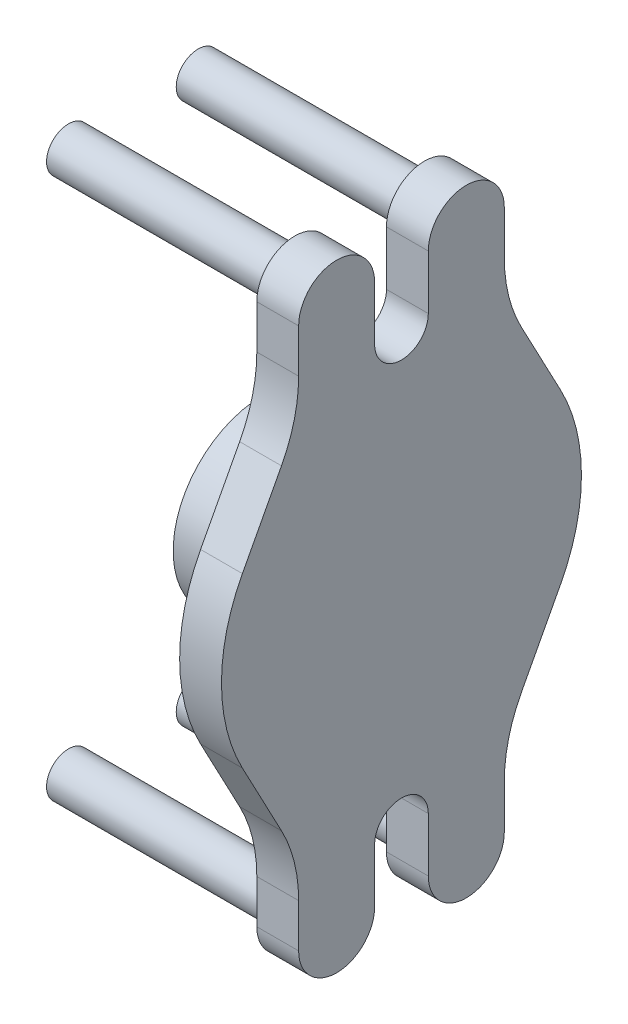
ISO-10303-21;
HEADER;
FILE_DESCRIPTION(('STEP AP214'),'2;1');
FILE_NAME('part.step','',(''),(''),'','','');
FILE_SCHEMA(('AUTOMOTIVE_DESIGN { 1 0 10303 214 1 1 1 1 }'));
ENDSEC;
DATA;
#1=APPLICATION_CONTEXT('core data for automotive mechanical design processes');
#2=APPLICATION_PROTOCOL_DEFINITION('international standard','automotive_design',2000,#1);
#3=PRODUCT_CONTEXT('',#1,'mechanical');
#4=PRODUCT('Part','Part','',(#3));
#5=PRODUCT_RELATED_PRODUCT_CATEGORY('part','',(#4));
#6=PRODUCT_DEFINITION_FORMATION('','',#4);
#7=PRODUCT_DEFINITION_CONTEXT('part definition',#1,'design');
#8=PRODUCT_DEFINITION('design','',#6,#7);
#9=PRODUCT_DEFINITION_SHAPE('','',#8);
#10=(LENGTH_UNIT() NAMED_UNIT(*) SI_UNIT(.MILLI.,.METRE.));
#11=(NAMED_UNIT(*) PLANE_ANGLE_UNIT() SI_UNIT($,.RADIAN.));
#12=(NAMED_UNIT(*) SI_UNIT($,.STERADIAN.) SOLID_ANGLE_UNIT());
#13=UNCERTAINTY_MEASURE_WITH_UNIT(LENGTH_MEASURE(1.E-05),#10,'distance_accuracy_value','');
#14=(GEOMETRIC_REPRESENTATION_CONTEXT(3) GLOBAL_UNCERTAINTY_ASSIGNED_CONTEXT((#13)) GLOBAL_UNIT_ASSIGNED_CONTEXT((#10,
#11,#12)) REPRESENTATION_CONTEXT('',''));
#15=CARTESIAN_POINT('',(0.,0.,0.));
#16=DIRECTION('',(0.,0.,1.));
#17=DIRECTION('',(1.,0.,0.));
#18=AXIS2_PLACEMENT_3D('',#15,#16,#17);
#19=CARTESIAN_POINT('',(36.4,17.1151545626375,32.3245303182742));
#20=DIRECTION('',(0.,-0.467934015820141,-0.883763405464628));
#21=DIRECTION('',(0.,0.883763405464628,-0.467934015820141));
#22=AXIS2_PLACEMENT_3D('',#19,#20,#21);
#23=PLANE('',#22);
#24=DIRECTION('',(0.,-0.883763405464628,0.467934015820141));
#25=VECTOR('',#24,1.);
#26=CARTESIAN_POINT('',(27.9,17.1151545626375,32.3245303182742));
#27=LINE('',#26,#25);
#28=CARTESIAN_POINT('',(27.9,32.1151545626375,24.3823478360612));
#29=VERTEX_POINT('',#28);
#30=CARTESIAN_POINT('',(27.9,17.1151545626375,32.3245303182742));
#31=VERTEX_POINT('',#30);
#32=EDGE_CURVE('E237',#29,#31,#27,.T.);
#33=ORIENTED_EDGE('',*,*,#32,.T.);
#34=DIRECTION('',(-1.,0.,0.));
#35=VECTOR('',#34,1.);
#36=CARTESIAN_POINT('',(36.4,17.1151545626375,32.3245303182742));
#37=LINE('',#36,#35);
#38=CARTESIAN_POINT('',(36.4,17.1151545626375,32.3245303182742));
#39=VERTEX_POINT('',#38);
#40=EDGE_CURVE('E346',#39,#31,#37,.T.);
#41=ORIENTED_EDGE('',*,*,#40,.F.);
#42=DIRECTION('',(0.,-0.883763405464628,0.467934015820141));
#43=VECTOR('',#42,1.);
#44=CARTESIAN_POINT('',(36.4,17.1151545626375,32.3245303182742));
#45=LINE('',#44,#43);
#46=CARTESIAN_POINT('',(36.4,32.1151545626375,24.3823478360612));
#47=VERTEX_POINT('',#46);
#48=EDGE_CURVE('E296',#47,#39,#45,.T.);
#49=ORIENTED_EDGE('',*,*,#48,.F.);
#50=DIRECTION('',(-1.,0.,0.));
#51=VECTOR('',#50,1.);
#52=CARTESIAN_POINT('',(36.4,32.1151545626375,24.3823478360612));
#53=LINE('',#52,#51);
#54=EDGE_CURVE('E233',#47,#29,#53,.T.);
#55=ORIENTED_EDGE('',*,*,#54,.T.);
#56=EDGE_LOOP('',(#33,#41,#49,#55));
#57=FACE_BOUND('',#56,.T.);
#58=ADVANCED_FACE('F44',(#57),#23,.F.);
#59=CARTESIAN_POINT('',(36.4,0.,0.));
#60=DIRECTION('',(-1.,0.,0.));
#61=DIRECTION('',(0.,-1.,0.));
#62=AXIS2_PLACEMENT_3D('',#59,#60,#61);
#63=CYLINDRICAL_SURFACE('',#62,36.576);
#64=CARTESIAN_POINT('',(27.9,0.,0.));
#65=DIRECTION('',(1.,0.,0.));
#66=DIRECTION('',(0.,1.,0.));
#67=AXIS2_PLACEMENT_3D('',#64,#65,#66);
#68=CIRCLE('',#67,36.576);
#69=CARTESIAN_POINT('',(27.9,-17.1151545626375,32.3245303182742));
#70=VERTEX_POINT('',#69);
#71=EDGE_CURVE('E240',#31,#70,#68,.T.);
#72=ORIENTED_EDGE('',*,*,#71,.T.);
#73=DIRECTION('',(-1.,0.,0.));
#74=VECTOR('',#73,1.);
#75=CARTESIAN_POINT('',(36.4,-17.1151545626375,32.3245303182742));
#76=LINE('',#75,#74);
#77=CARTESIAN_POINT('',(36.4,-17.1151545626375,32.3245303182742));
#78=VERTEX_POINT('',#77);
#79=EDGE_CURVE('E344',#78,#70,#76,.T.);
#80=ORIENTED_EDGE('',*,*,#79,.F.);
#81=CARTESIAN_POINT('',(36.4,0.,0.));
#82=DIRECTION('',(1.,0.,0.));
#83=DIRECTION('',(0.,1.,0.));
#84=AXIS2_PLACEMENT_3D('',#81,#82,#83);
#85=CIRCLE('',#84,36.576);
#86=EDGE_CURVE('E152',#39,#78,#85,.T.);
#87=ORIENTED_EDGE('',*,*,#86,.F.);
#88=ORIENTED_EDGE('',*,*,#40,.T.);
#89=EDGE_LOOP('',(#72,#80,#87,#88));
#90=FACE_BOUND('',#89,.T.);
#91=ADVANCED_FACE('F382',(#90),#63,.T.);
#92=CARTESIAN_POINT('',(36.4,-17.1151545626375,32.3245303182742));
#93=DIRECTION('',(0.,-0.467934015820141,0.883763405464628));
#94=DIRECTION('',(0.,-0.883763405464628,-0.467934015820141));
#95=AXIS2_PLACEMENT_3D('',#92,#93,#94);
#96=PLANE('',#95);
#97=DIRECTION('',(0.,0.883763405464628,0.467934015820141));
#98=VECTOR('',#97,1.);
#99=CARTESIAN_POINT('',(27.9,-17.1151545626375,32.3245303182742));
#100=LINE('',#99,#98);
#101=CARTESIAN_POINT('',(27.9,-32.1151545626375,24.3823478360612));
#102=VERTEX_POINT('',#101);
#103=EDGE_CURVE('E244',#102,#70,#100,.T.);
#104=ORIENTED_EDGE('',*,*,#103,.F.);
#105=DIRECTION('',(-1.,0.,0.));
#106=VECTOR('',#105,1.);
#107=CARTESIAN_POINT('',(36.4,-32.1151545626374,24.3823478360612));
#108=LINE('',#107,#106);
#109=CARTESIAN_POINT('',(36.4,-32.1151545626374,24.3823478360612));
#110=VERTEX_POINT('',#109);
#111=EDGE_CURVE('E342',#110,#102,#108,.T.);
#112=ORIENTED_EDGE('',*,*,#111,.F.);
#113=DIRECTION('',(0.,0.883763405464628,0.467934015820141));
#114=VECTOR('',#113,1.);
#115=CARTESIAN_POINT('',(36.4,-17.1151545626375,32.3245303182742));
#116=LINE('',#115,#114);
#117=EDGE_CURVE('E587',#110,#78,#116,.T.);
#118=ORIENTED_EDGE('',*,*,#117,.T.);
#119=ORIENTED_EDGE('',*,*,#79,.T.);
#120=EDGE_LOOP('',(#104,#112,#118,#119));
#121=FACE_BOUND('',#120,.T.);
#122=ADVANCED_FACE('F386',(#121),#96,.T.);
#123=CARTESIAN_POINT('',(36.4,-46.1531750372417,50.89525));
#124=DIRECTION('',(-1.,0.,0.));
#125=DIRECTION('',(0.,-1.,0.));
#126=AXIS2_PLACEMENT_3D('',#123,#124,#125);
#127=CYLINDRICAL_SURFACE('',#126,30.);
#128=CARTESIAN_POINT('',(27.9,-46.1531750372417,50.89525));
#129=DIRECTION('',(1.,0.,0.));
#130=DIRECTION('',(0.,1.,0.));
#131=AXIS2_PLACEMENT_3D('',#128,#129,#130);
#132=CIRCLE('',#131,30.);
#133=CARTESIAN_POINT('',(27.9,-46.1531750372417,20.89525));
#134=VERTEX_POINT('',#133);
#135=EDGE_CURVE('E247',#134,#102,#132,.T.);
#136=ORIENTED_EDGE('',*,*,#135,.F.);
#137=DIRECTION('',(-1.,0.,0.));
#138=VECTOR('',#137,1.);
#139=CARTESIAN_POINT('',(36.4,-46.1531750372417,20.89525));
#140=LINE('',#139,#138);
#141=CARTESIAN_POINT('',(36.4,-46.1531750372417,20.89525));
#142=VERTEX_POINT('',#141);
#143=EDGE_CURVE('E340',#142,#134,#140,.T.);
#144=ORIENTED_EDGE('',*,*,#143,.F.);
#145=CARTESIAN_POINT('',(36.4,-46.1531750372417,50.89525));
#146=DIRECTION('',(1.,0.,0.));
#147=DIRECTION('',(0.,1.,0.));
#148=AXIS2_PLACEMENT_3D('',#145,#146,#147);
#149=CIRCLE('',#148,30.);
#150=EDGE_CURVE('E590',#142,#110,#149,.T.);
#151=ORIENTED_EDGE('',*,*,#150,.T.);
#152=ORIENTED_EDGE('',*,*,#111,.T.);
#153=EDGE_LOOP('',(#136,#144,#151,#152));
#154=FACE_BOUND('',#153,.T.);
#155=ADVANCED_FACE('F390',(#154),#127,.F.);
#156=CARTESIAN_POINT('',(36.4,0.,20.89525));
#157=DIRECTION('',(0.,0.,1.));
#158=DIRECTION('',(0.,-1.,0.));
#159=AXIS2_PLACEMENT_3D('',#156,#157,#158);
#160=PLANE('',#159);
#161=DIRECTION('',(0.,1.,0.));
#162=VECTOR('',#161,1.);
#163=CARTESIAN_POINT('',(27.9,0.,20.89525));
#164=LINE('',#163,#162);
#165=CARTESIAN_POINT('',(27.9,-55.,20.89525));
#166=VERTEX_POINT('',#165);
#167=EDGE_CURVE('E250',#166,#134,#164,.T.);
#168=ORIENTED_EDGE('',*,*,#167,.F.);
#169=DIRECTION('',(-1.,0.,0.));
#170=VECTOR('',#169,1.);
#171=CARTESIAN_POINT('',(36.4,-55.,20.89525));
#172=LINE('',#171,#170);
#173=CARTESIAN_POINT('',(36.4,-55.,20.89525));
#174=VERTEX_POINT('',#173);
#175=EDGE_CURVE('E338',#174,#166,#172,.T.);
#176=ORIENTED_EDGE('',*,*,#175,.F.);
#177=DIRECTION('',(0.,1.,0.));
#178=VECTOR('',#177,1.);
#179=CARTESIAN_POINT('',(36.4,0.,20.89525));
#180=LINE('',#179,#178);
#181=EDGE_CURVE('E593',#174,#142,#180,.T.);
#182=ORIENTED_EDGE('',*,*,#181,.T.);
#183=ORIENTED_EDGE('',*,*,#143,.T.);
#184=EDGE_LOOP('',(#168,#176,#182,#183));
#185=FACE_BOUND('',#184,.T.);
#186=ADVANCED_FACE('F396',(#185),#160,.T.);
#187=CARTESIAN_POINT('',(36.4,-55.,13.175));
#188=DIRECTION('',(-1.,0.,0.));
#189=DIRECTION('',(0.,-1.,0.));
#190=AXIS2_PLACEMENT_3D('',#187,#188,#189);
#191=CYLINDRICAL_SURFACE('',#190,7.72025);
#192=CARTESIAN_POINT('',(27.9,-55.,13.175));
#193=DIRECTION('',(1.,0.,0.));
#194=DIRECTION('',(0.,1.,0.));
#195=AXIS2_PLACEMENT_3D('',#192,#193,#194);
#196=CIRCLE('',#195,7.72025);
#197=CARTESIAN_POINT('',(27.9,-55.,5.45475));
#198=VERTEX_POINT('',#197);
#199=EDGE_CURVE('E253',#166,#198,#196,.T.);
#200=ORIENTED_EDGE('',*,*,#199,.T.);
#201=DIRECTION('',(-1.,0.,0.));
#202=VECTOR('',#201,1.);
#203=CARTESIAN_POINT('',(36.4,-55.,5.45475));
#204=LINE('',#203,#202);
#205=CARTESIAN_POINT('',(36.4,-55.,5.45475));
#206=VERTEX_POINT('',#205);
#207=EDGE_CURVE('E335',#206,#198,#204,.T.);
#208=ORIENTED_EDGE('',*,*,#207,.F.);
#209=CARTESIAN_POINT('',(36.4,-55.,13.175));
#210=DIRECTION('',(1.,0.,0.));
#211=DIRECTION('',(0.,1.,0.));
#212=AXIS2_PLACEMENT_3D('',#209,#210,#211);
#213=CIRCLE('',#212,7.72025);
#214=EDGE_CURVE('E596',#174,#206,#213,.T.);
#215=ORIENTED_EDGE('',*,*,#214,.F.);
#216=ORIENTED_EDGE('',*,*,#175,.T.);
#217=EDGE_LOOP('',(#200,#208,#215,#216));
#218=FACE_BOUND('',#217,.T.);
#219=ADVANCED_FACE('F400',(#218),#191,.T.);
#220=CARTESIAN_POINT('',(36.4,0.,5.45475000000001));
#221=DIRECTION('',(0.,0.,1.));
#222=DIRECTION('',(0.,-1.,0.));
#223=AXIS2_PLACEMENT_3D('',#220,#221,#222);
#224=PLANE('',#223);
#225=DIRECTION('',(0.,1.,0.));
#226=VECTOR('',#225,1.);
#227=CARTESIAN_POINT('',(27.9,0.,5.45475000000001));
#228=LINE('',#227,#226);
#229=CARTESIAN_POINT('',(27.9,-44.,5.45475));
#230=VERTEX_POINT('',#229);
#231=EDGE_CURVE('E255',#198,#230,#228,.T.);
#232=ORIENTED_EDGE('',*,*,#231,.T.);
#233=DIRECTION('',(-1.,0.,0.));
#234=VECTOR('',#233,1.);
#235=CARTESIAN_POINT('',(36.4,-44.,5.45475));
#236=LINE('',#235,#234);
#237=CARTESIAN_POINT('',(36.4,-44.,5.45475));
#238=VERTEX_POINT('',#237);
#239=EDGE_CURVE('E332',#238,#230,#236,.T.);
#240=ORIENTED_EDGE('',*,*,#239,.F.);
#241=DIRECTION('',(0.,1.,0.));
#242=VECTOR('',#241,1.);
#243=CARTESIAN_POINT('',(36.4,0.,5.45475000000001));
#244=LINE('',#243,#242);
#245=EDGE_CURVE('E598',#206,#238,#244,.T.);
#246=ORIENTED_EDGE('',*,*,#245,.F.);
#247=ORIENTED_EDGE('',*,*,#207,.T.);
#248=EDGE_LOOP('',(#232,#240,#246,#247));
#249=FACE_BOUND('',#248,.T.);
#250=ADVANCED_FACE('F404',(#249),#224,.F.);
#251=CARTESIAN_POINT('',(36.4,-44.,0.));
#252=DIRECTION('',(-1.,0.,0.));
#253=DIRECTION('',(0.,-1.,0.));
#254=AXIS2_PLACEMENT_3D('',#251,#252,#253);
#255=CYLINDRICAL_SURFACE('',#254,5.45475);
#256=CARTESIAN_POINT('',(27.9,-44.,0.));
#257=DIRECTION('',(1.,0.,0.));
#258=DIRECTION('',(0.,1.,0.));
#259=AXIS2_PLACEMENT_3D('',#256,#257,#258);
#260=CIRCLE('',#259,5.45475);
#261=CARTESIAN_POINT('',(27.9,-44.,-5.45474999999999));
#262=VERTEX_POINT('',#261);
#263=EDGE_CURVE('E257',#230,#262,#260,.F.);
#264=ORIENTED_EDGE('',*,*,#263,.T.);
#265=DIRECTION('',(-1.,0.,0.));
#266=VECTOR('',#265,1.);
#267=CARTESIAN_POINT('',(36.4,-44.,-5.45474999999999));
#268=LINE('',#267,#266);
#269=CARTESIAN_POINT('',(36.4,-44.,-5.45474999999999));
#270=VERTEX_POINT('',#269);
#271=EDGE_CURVE('E329',#270,#262,#268,.T.);
#272=ORIENTED_EDGE('',*,*,#271,.F.);
#273=CARTESIAN_POINT('',(36.4,-44.,0.));
#274=DIRECTION('',(1.,0.,0.));
#275=DIRECTION('',(0.,1.,0.));
#276=AXIS2_PLACEMENT_3D('',#273,#274,#275);
#277=CIRCLE('',#276,5.45475);
#278=EDGE_CURVE('E600',#238,#270,#277,.F.);
#279=ORIENTED_EDGE('',*,*,#278,.F.);
#280=ORIENTED_EDGE('',*,*,#239,.T.);
#281=EDGE_LOOP('',(#264,#272,#279,#280));
#282=FACE_BOUND('',#281,.T.);
#283=ADVANCED_FACE('F408',(#282),#255,.F.);
#284=CARTESIAN_POINT('',(36.4,0.,-5.45474999999999));
#285=DIRECTION('',(0.,0.,-1.));
#286=DIRECTION('',(0.,1.,0.));
#287=AXIS2_PLACEMENT_3D('',#284,#285,#286);
#288=PLANE('',#287);
#289=DIRECTION('',(0.,-1.,0.));
#290=VECTOR('',#289,1.);
#291=CARTESIAN_POINT('',(27.9,0.,-5.45474999999999));
#292=LINE('',#291,#290);
#293=CARTESIAN_POINT('',(27.9,-55.,-5.45474999999999));
#294=VERTEX_POINT('',#293);
#295=EDGE_CURVE('E259',#262,#294,#292,.T.);
#296=ORIENTED_EDGE('',*,*,#295,.T.);
#297=DIRECTION('',(-1.,0.,0.));
#298=VECTOR('',#297,1.);
#299=CARTESIAN_POINT('',(36.4,-55.,-5.45474999999999));
#300=LINE('',#299,#298);
#301=CARTESIAN_POINT('',(36.4,-55.,-5.45474999999999));
#302=VERTEX_POINT('',#301);
#303=EDGE_CURVE('E326',#302,#294,#300,.T.);
#304=ORIENTED_EDGE('',*,*,#303,.F.);
#305=DIRECTION('',(0.,-1.,0.));
#306=VECTOR('',#305,1.);
#307=CARTESIAN_POINT('',(36.4,0.,-5.45474999999999));
#308=LINE('',#307,#306);
#309=EDGE_CURVE('E602',#270,#302,#308,.T.);
#310=ORIENTED_EDGE('',*,*,#309,.F.);
#311=ORIENTED_EDGE('',*,*,#271,.T.);
#312=EDGE_LOOP('',(#296,#304,#310,#311));
#313=FACE_BOUND('',#312,.T.);
#314=ADVANCED_FACE('F412',(#313),#288,.F.);
#315=CARTESIAN_POINT('',(36.4,-55.,-13.175));
#316=DIRECTION('',(-1.,0.,0.));
#317=DIRECTION('',(0.,-1.,0.));
#318=AXIS2_PLACEMENT_3D('',#315,#316,#317);
#319=CYLINDRICAL_SURFACE('',#318,7.72025);
#320=CARTESIAN_POINT('',(27.9,-55.,-13.175));
#321=DIRECTION('',(1.,0.,0.));
#322=DIRECTION('',(0.,1.,0.));
#323=AXIS2_PLACEMENT_3D('',#320,#321,#322);
#324=CIRCLE('',#323,7.72025);
#325=CARTESIAN_POINT('',(27.9,-55.,-20.89525));
#326=VERTEX_POINT('',#325);
#327=EDGE_CURVE('E261',#294,#326,#324,.T.);
#328=ORIENTED_EDGE('',*,*,#327,.T.);
#329=DIRECTION('',(-1.,0.,0.));
#330=VECTOR('',#329,1.);
#331=CARTESIAN_POINT('',(36.4,-55.,-20.89525));
#332=LINE('',#331,#330);
#333=CARTESIAN_POINT('',(36.4,-55.,-20.89525));
#334=VERTEX_POINT('',#333);
#335=EDGE_CURVE('E323',#334,#326,#332,.T.);
#336=ORIENTED_EDGE('',*,*,#335,.F.);
#337=CARTESIAN_POINT('',(36.4,-55.,-13.175));
#338=DIRECTION('',(1.,0.,0.));
#339=DIRECTION('',(0.,1.,0.));
#340=AXIS2_PLACEMENT_3D('',#337,#338,#339);
#341=CIRCLE('',#340,7.72025);
#342=EDGE_CURVE('E604',#302,#334,#341,.T.);
#343=ORIENTED_EDGE('',*,*,#342,.F.);
#344=ORIENTED_EDGE('',*,*,#303,.T.);
#345=EDGE_LOOP('',(#328,#336,#343,#344));
#346=FACE_BOUND('',#345,.T.);
#347=ADVANCED_FACE('F416',(#346),#319,.T.);
#348=CARTESIAN_POINT('',(36.4,0.,-20.89525));
#349=DIRECTION('',(0.,0.,1.));
#350=DIRECTION('',(1.,0.,0.));
#351=AXIS2_PLACEMENT_3D('',#348,#349,#350);
#352=PLANE('',#351);
#353=DIRECTION('',(0.,1.,0.));
#354=VECTOR('',#353,1.);
#355=CARTESIAN_POINT('',(27.9,0.,-20.89525));
#356=LINE('',#355,#354);
#357=CARTESIAN_POINT('',(27.9,-46.1531750372417,-20.89525));
#358=VERTEX_POINT('',#357);
#359=EDGE_CURVE('E263',#326,#358,#356,.T.);
#360=ORIENTED_EDGE('',*,*,#359,.T.);
#361=DIRECTION('',(-1.,0.,0.));
#362=VECTOR('',#361,1.);
#363=CARTESIAN_POINT('',(36.4,-46.1531750372417,-20.89525));
#364=LINE('',#363,#362);
#365=CARTESIAN_POINT('',(36.4,-46.1531750372417,-20.89525));
#366=VERTEX_POINT('',#365);
#367=EDGE_CURVE('E320',#366,#358,#364,.T.);
#368=ORIENTED_EDGE('',*,*,#367,.F.);
#369=DIRECTION('',(0.,1.,0.));
#370=VECTOR('',#369,1.);
#371=CARTESIAN_POINT('',(36.4,0.,-20.89525));
#372=LINE('',#371,#370);
#373=EDGE_CURVE('E606',#334,#366,#372,.T.);
#374=ORIENTED_EDGE('',*,*,#373,.F.);
#375=ORIENTED_EDGE('',*,*,#335,.T.);
#376=EDGE_LOOP('',(#360,#368,#374,#375));
#377=FACE_BOUND('',#376,.T.);
#378=ADVANCED_FACE('F420',(#377),#352,.F.);
#379=CARTESIAN_POINT('',(36.4,-46.1531750372417,-50.89525));
#380=DIRECTION('',(-1.,0.,0.));
#381=DIRECTION('',(0.,-1.,0.));
#382=AXIS2_PLACEMENT_3D('',#379,#380,#381);
#383=CYLINDRICAL_SURFACE('',#382,30.);
#384=CARTESIAN_POINT('',(27.9,-46.1531750372417,-50.89525));
#385=DIRECTION('',(1.,0.,0.));
#386=DIRECTION('',(0.,1.,0.));
#387=AXIS2_PLACEMENT_3D('',#384,#385,#386);
#388=CIRCLE('',#387,30.);
#389=CARTESIAN_POINT('',(27.9,-32.1151545626375,-24.3823478360612));
#390=VERTEX_POINT('',#389);
#391=EDGE_CURVE('E265',#358,#390,#388,.F.);
#392=ORIENTED_EDGE('',*,*,#391,.T.);
#393=DIRECTION('',(-1.,0.,0.));
#394=VECTOR('',#393,1.);
#395=CARTESIAN_POINT('',(36.4,-32.1151545626375,-24.3823478360612));
#396=LINE('',#395,#394);
#397=CARTESIAN_POINT('',(36.4,-32.1151545626375,-24.3823478360612));
#398=VERTEX_POINT('',#397);
#399=EDGE_CURVE('E317',#398,#390,#396,.T.);
#400=ORIENTED_EDGE('',*,*,#399,.F.);
#401=CARTESIAN_POINT('',(36.4,-46.1531750372417,-50.89525));
#402=DIRECTION('',(1.,0.,0.));
#403=DIRECTION('',(0.,1.,0.));
#404=AXIS2_PLACEMENT_3D('',#401,#402,#403);
#405=CIRCLE('',#404,30.);
#406=EDGE_CURVE('E608',#366,#398,#405,.F.);
#407=ORIENTED_EDGE('',*,*,#406,.F.);
#408=ORIENTED_EDGE('',*,*,#367,.T.);
#409=EDGE_LOOP('',(#392,#400,#407,#408));
#410=FACE_BOUND('',#409,.T.);
#411=ADVANCED_FACE('F424',(#410),#383,.F.);
#412=CARTESIAN_POINT('',(36.4,-17.1151545626375,-32.3245303182742));
#413=DIRECTION('',(0.,0.467934015820141,0.883763405464628));
#414=DIRECTION('',(0.,-0.883763405464628,0.467934015820141));
#415=AXIS2_PLACEMENT_3D('',#412,#413,#414);
#416=PLANE('',#415);
#417=DIRECTION('',(0.,0.883763405464628,-0.467934015820141));
#418=VECTOR('',#417,1.);
#419=CARTESIAN_POINT('',(27.9,-17.1151545626375,-32.3245303182742));
#420=LINE('',#419,#418);
#421=CARTESIAN_POINT('',(27.9,-17.1151545626375,-32.3245303182742));
#422=VERTEX_POINT('',#421);
#423=EDGE_CURVE('E267',#390,#422,#420,.T.);
#424=ORIENTED_EDGE('',*,*,#423,.T.);
#425=DIRECTION('',(-1.,0.,0.));
#426=VECTOR('',#425,1.);
#427=CARTESIAN_POINT('',(36.4,-17.1151545626375,-32.3245303182742));
#428=LINE('',#427,#426);
#429=CARTESIAN_POINT('',(36.4,-17.1151545626375,-32.3245303182742));
#430=VERTEX_POINT('',#429);
#431=EDGE_CURVE('E314',#430,#422,#428,.T.);
#432=ORIENTED_EDGE('',*,*,#431,.F.);
#433=DIRECTION('',(0.,0.883763405464628,-0.467934015820141));
#434=VECTOR('',#433,1.);
#435=CARTESIAN_POINT('',(36.4,-17.1151545626375,-32.3245303182742));
#436=LINE('',#435,#434);
#437=EDGE_CURVE('E610',#398,#430,#436,.T.);
#438=ORIENTED_EDGE('',*,*,#437,.F.);
#439=ORIENTED_EDGE('',*,*,#399,.T.);
#440=EDGE_LOOP('',(#424,#432,#438,#439));
#441=FACE_BOUND('',#440,.T.);
#442=ADVANCED_FACE('F428',(#441),#416,.F.);
#443=CARTESIAN_POINT('',(36.4,0.,0.));
#444=DIRECTION('',(-1.,0.,0.));
#445=DIRECTION('',(0.,-1.,0.));
#446=AXIS2_PLACEMENT_3D('',#443,#444,#445);
#447=CYLINDRICAL_SURFACE('',#446,36.576);
#448=CARTESIAN_POINT('',(27.9,0.,0.));
#449=DIRECTION('',(1.,0.,0.));
#450=DIRECTION('',(0.,1.,0.));
#451=AXIS2_PLACEMENT_3D('',#448,#449,#450);
#452=CIRCLE('',#451,36.576);
#453=CARTESIAN_POINT('',(27.9,17.1151545626375,-32.3245303182742));
#454=VERTEX_POINT('',#453);
#455=EDGE_CURVE('E269',#422,#454,#452,.T.);
#456=ORIENTED_EDGE('',*,*,#455,.T.);
#457=DIRECTION('',(-1.,0.,0.));
#458=VECTOR('',#457,1.);
#459=CARTESIAN_POINT('',(36.4,17.1151545626375,-32.3245303182742));
#460=LINE('',#459,#458);
#461=CARTESIAN_POINT('',(36.4,17.1151545626375,-32.3245303182742));
#462=VERTEX_POINT('',#461);
#463=EDGE_CURVE('E312',#462,#454,#460,.T.);
#464=ORIENTED_EDGE('',*,*,#463,.F.);
#465=CARTESIAN_POINT('',(36.4,0.,0.));
#466=DIRECTION('',(1.,0.,0.));
#467=DIRECTION('',(0.,1.,0.));
#468=AXIS2_PLACEMENT_3D('',#465,#466,#467);
#469=CIRCLE('',#468,36.576);
#470=EDGE_CURVE('E612',#430,#462,#469,.T.);
#471=ORIENTED_EDGE('',*,*,#470,.F.);
#472=ORIENTED_EDGE('',*,*,#431,.T.);
#473=EDGE_LOOP('',(#456,#464,#471,#472));
#474=FACE_BOUND('',#473,.T.);
#475=ADVANCED_FACE('F432',(#474),#447,.T.);
#476=CARTESIAN_POINT('',(36.4,17.1151545626375,-32.3245303182742));
#477=DIRECTION('',(0.,0.467934015820141,-0.883763405464628));
#478=DIRECTION('',(0.,0.883763405464628,0.467934015820141));
#479=AXIS2_PLACEMENT_3D('',#476,#477,#478);
#480=PLANE('',#479);
#481=DIRECTION('',(0.,-0.883763405464628,-0.467934015820141));
#482=VECTOR('',#481,1.);
#483=CARTESIAN_POINT('',(27.9,17.1151545626375,-32.3245303182742));
#484=LINE('',#483,#482);
#485=CARTESIAN_POINT('',(27.9,32.1151545626375,-24.3823478360612));
#486=VERTEX_POINT('',#485);
#487=EDGE_CURVE('E272',#486,#454,#484,.T.);
#488=ORIENTED_EDGE('',*,*,#487,.F.);
#489=DIRECTION('',(-1.,0.,0.));
#490=VECTOR('',#489,1.);
#491=CARTESIAN_POINT('',(36.4,32.1151545626375,-24.3823478360612));
#492=LINE('',#491,#490);
#493=CARTESIAN_POINT('',(36.4,32.1151545626375,-24.3823478360612));
#494=VERTEX_POINT('',#493);
#495=EDGE_CURVE('E310',#494,#486,#492,.T.);
#496=ORIENTED_EDGE('',*,*,#495,.F.);
#497=DIRECTION('',(0.,-0.883763405464628,-0.467934015820141));
#498=VECTOR('',#497,1.);
#499=CARTESIAN_POINT('',(36.4,17.1151545626375,-32.3245303182742));
#500=LINE('',#499,#498);
#501=EDGE_CURVE('E614',#494,#462,#500,.T.);
#502=ORIENTED_EDGE('',*,*,#501,.T.);
#503=ORIENTED_EDGE('',*,*,#463,.T.);
#504=EDGE_LOOP('',(#488,#496,#502,#503));
#505=FACE_BOUND('',#504,.T.);
#506=ADVANCED_FACE('F436',(#505),#480,.T.);
#507=CARTESIAN_POINT('',(36.4,46.1531750372417,-50.89525));
#508=DIRECTION('',(-1.,0.,0.));
#509=DIRECTION('',(0.,-1.,0.));
#510=AXIS2_PLACEMENT_3D('',#507,#508,#509);
#511=CYLINDRICAL_SURFACE('',#510,30.);
#512=CARTESIAN_POINT('',(27.9,46.1531750372417,-50.89525));
#513=DIRECTION('',(1.,0.,0.));
#514=DIRECTION('',(0.,1.,0.));
#515=AXIS2_PLACEMENT_3D('',#512,#513,#514);
#516=CIRCLE('',#515,30.);
#517=CARTESIAN_POINT('',(27.9,46.1531750372417,-20.89525));
#518=VERTEX_POINT('',#517);
#519=EDGE_CURVE('E275',#518,#486,#516,.T.);
#520=ORIENTED_EDGE('',*,*,#519,.F.);
#521=DIRECTION('',(-1.,0.,0.));
#522=VECTOR('',#521,1.);
#523=CARTESIAN_POINT('',(36.4,46.1531750372417,-20.89525));
#524=LINE('',#523,#522);
#525=CARTESIAN_POINT('',(36.4,46.1531750372417,-20.89525));
#526=VERTEX_POINT('',#525);
#527=EDGE_CURVE('E308',#526,#518,#524,.T.);
#528=ORIENTED_EDGE('',*,*,#527,.F.);
#529=CARTESIAN_POINT('',(36.4,46.1531750372417,-50.89525));
#530=DIRECTION('',(1.,0.,0.));
#531=DIRECTION('',(0.,1.,0.));
#532=AXIS2_PLACEMENT_3D('',#529,#530,#531);
#533=CIRCLE('',#532,30.);
#534=EDGE_CURVE('E617',#526,#494,#533,.T.);
#535=ORIENTED_EDGE('',*,*,#534,.T.);
#536=ORIENTED_EDGE('',*,*,#495,.T.);
#537=EDGE_LOOP('',(#520,#528,#535,#536));
#538=FACE_BOUND('',#537,.T.);
#539=ADVANCED_FACE('F440',(#538),#511,.F.);
#540=CARTESIAN_POINT('',(36.4,0.,-20.89525));
#541=DIRECTION('',(0.,0.,-1.));
#542=DIRECTION('',(-1.,0.,0.));
#543=AXIS2_PLACEMENT_3D('',#540,#541,#542);
#544=PLANE('',#543);
#545=DIRECTION('',(0.,-1.,0.));
#546=VECTOR('',#545,1.);
#547=CARTESIAN_POINT('',(27.9,0.,-20.89525));
#548=LINE('',#547,#546);
#549=CARTESIAN_POINT('',(27.9,55.,-20.89525));
#550=VERTEX_POINT('',#549);
#551=EDGE_CURVE('E278',#550,#518,#548,.T.);
#552=ORIENTED_EDGE('',*,*,#551,.F.);
#553=DIRECTION('',(-1.,0.,0.));
#554=VECTOR('',#553,1.);
#555=CARTESIAN_POINT('',(36.4,55.,-20.89525));
#556=LINE('',#555,#554);
#557=CARTESIAN_POINT('',(36.4,55.,-20.89525));
#558=VERTEX_POINT('',#557);
#559=EDGE_CURVE('E306',#558,#550,#556,.T.);
#560=ORIENTED_EDGE('',*,*,#559,.F.);
#561=DIRECTION('',(0.,-1.,0.));
#562=VECTOR('',#561,1.);
#563=CARTESIAN_POINT('',(36.4,0.,-20.89525));
#564=LINE('',#563,#562);
#565=EDGE_CURVE('E620',#558,#526,#564,.T.);
#566=ORIENTED_EDGE('',*,*,#565,.T.);
#567=ORIENTED_EDGE('',*,*,#527,.T.);
#568=EDGE_LOOP('',(#552,#560,#566,#567));
#569=FACE_BOUND('',#568,.T.);
#570=ADVANCED_FACE('F444',(#569),#544,.T.);
#571=CARTESIAN_POINT('',(36.4,55.,-13.175));
#572=DIRECTION('',(-1.,0.,0.));
#573=DIRECTION('',(0.,-1.,0.));
#574=AXIS2_PLACEMENT_3D('',#571,#572,#573);
#575=CYLINDRICAL_SURFACE('',#574,7.72025);
#576=CARTESIAN_POINT('',(27.9,55.,-13.175));
#577=DIRECTION('',(1.,0.,0.));
#578=DIRECTION('',(0.,1.,0.));
#579=AXIS2_PLACEMENT_3D('',#576,#577,#578);
#580=CIRCLE('',#579,7.72025);
#581=CARTESIAN_POINT('',(27.9,55.,-5.45474999999999));
#582=VERTEX_POINT('',#581);
#583=EDGE_CURVE('E281',#550,#582,#580,.T.);
#584=ORIENTED_EDGE('',*,*,#583,.T.);
#585=DIRECTION('',(-1.,0.,0.));
#586=VECTOR('',#585,1.);
#587=CARTESIAN_POINT('',(36.4,55.,-5.45474999999999));
#588=LINE('',#587,#586);
#589=CARTESIAN_POINT('',(36.4,55.,-5.45474999999999));
#590=VERTEX_POINT('',#589);
#591=EDGE_CURVE('E304',#590,#582,#588,.T.);
#592=ORIENTED_EDGE('',*,*,#591,.F.);
#593=CARTESIAN_POINT('',(36.4,55.,-13.175));
#594=DIRECTION('',(1.,0.,0.));
#595=DIRECTION('',(0.,1.,0.));
#596=AXIS2_PLACEMENT_3D('',#593,#594,#595);
#597=CIRCLE('',#596,7.72025);
#598=EDGE_CURVE('E623',#558,#590,#597,.T.);
#599=ORIENTED_EDGE('',*,*,#598,.F.);
#600=ORIENTED_EDGE('',*,*,#559,.T.);
#601=EDGE_LOOP('',(#584,#592,#599,#600));
#602=FACE_BOUND('',#601,.T.);
#603=ADVANCED_FACE('F448',(#602),#575,.T.);
#604=CARTESIAN_POINT('',(36.4,0.,-5.45474999999999));
#605=DIRECTION('',(0.,0.,1.));
#606=DIRECTION('',(0.,-1.,0.));
#607=AXIS2_PLACEMENT_3D('',#604,#605,#606);
#608=PLANE('',#607);
#609=DIRECTION('',(0.,1.,0.));
#610=VECTOR('',#609,1.);
#611=CARTESIAN_POINT('',(27.9,0.,-5.45474999999999));
#612=LINE('',#611,#610);
#613=CARTESIAN_POINT('',(27.9,44.,-5.45474999999999));
#614=VERTEX_POINT('',#613);
#615=EDGE_CURVE('E284',#614,#582,#612,.T.);
#616=ORIENTED_EDGE('',*,*,#615,.F.);
#617=DIRECTION('',(-1.,0.,0.));
#618=VECTOR('',#617,1.);
#619=CARTESIAN_POINT('',(36.4,44.,-5.45474999999999));
#620=LINE('',#619,#618);
#621=CARTESIAN_POINT('',(36.4,44.,-5.45474999999999));
#622=VERTEX_POINT('',#621);
#623=EDGE_CURVE('E302',#622,#614,#620,.T.);
#624=ORIENTED_EDGE('',*,*,#623,.F.);
#625=DIRECTION('',(0.,1.,0.));
#626=VECTOR('',#625,1.);
#627=CARTESIAN_POINT('',(36.4,0.,-5.45474999999999));
#628=LINE('',#627,#626);
#629=EDGE_CURVE('E625',#622,#590,#628,.T.);
#630=ORIENTED_EDGE('',*,*,#629,.T.);
#631=ORIENTED_EDGE('',*,*,#591,.T.);
#632=EDGE_LOOP('',(#616,#624,#630,#631));
#633=FACE_BOUND('',#632,.T.);
#634=ADVANCED_FACE('F452',(#633),#608,.T.);
#635=CARTESIAN_POINT('',(36.4,44.,0.));
#636=DIRECTION('',(-1.,0.,0.));
#637=DIRECTION('',(0.,-1.,0.));
#638=AXIS2_PLACEMENT_3D('',#635,#636,#637);
#639=CYLINDRICAL_SURFACE('',#638,5.45475);
#640=CARTESIAN_POINT('',(27.9,44.,0.));
#641=DIRECTION('',(1.,0.,0.));
#642=DIRECTION('',(0.,1.,0.));
#643=AXIS2_PLACEMENT_3D('',#640,#641,#642);
#644=CIRCLE('',#643,5.45475);
#645=CARTESIAN_POINT('',(27.9,44.,5.45475));
#646=VERTEX_POINT('',#645);
#647=EDGE_CURVE('E287',#646,#614,#644,.T.);
#648=ORIENTED_EDGE('',*,*,#647,.F.);
#649=DIRECTION('',(-1.,0.,0.));
#650=VECTOR('',#649,1.);
#651=CARTESIAN_POINT('',(36.4,44.,5.45475));
#652=LINE('',#651,#650);
#653=CARTESIAN_POINT('',(36.4,44.,5.45475));
#654=VERTEX_POINT('',#653);
#655=EDGE_CURVE('E300',#654,#646,#652,.T.);
#656=ORIENTED_EDGE('',*,*,#655,.F.);
#657=CARTESIAN_POINT('',(36.4,44.,0.));
#658=DIRECTION('',(1.,0.,0.));
#659=DIRECTION('',(0.,1.,0.));
#660=AXIS2_PLACEMENT_3D('',#657,#658,#659);
#661=CIRCLE('',#660,5.45475);
#662=EDGE_CURVE('E628',#654,#622,#661,.T.);
#663=ORIENTED_EDGE('',*,*,#662,.T.);
#664=ORIENTED_EDGE('',*,*,#623,.T.);
#665=EDGE_LOOP('',(#648,#656,#663,#664));
#666=FACE_BOUND('',#665,.T.);
#667=ADVANCED_FACE('F456',(#666),#639,.F.);
#668=CARTESIAN_POINT('',(36.4,0.,5.45475000000001));
#669=DIRECTION('',(0.,0.,-1.));
#670=DIRECTION('',(0.,1.,0.));
#671=AXIS2_PLACEMENT_3D('',#668,#669,#670);
#672=PLANE('',#671);
#673=DIRECTION('',(0.,-1.,0.));
#674=VECTOR('',#673,1.);
#675=CARTESIAN_POINT('',(27.9,0.,5.45475000000001));
#676=LINE('',#675,#674);
#677=CARTESIAN_POINT('',(27.9,55.,5.45475));
#678=VERTEX_POINT('',#677);
#679=EDGE_CURVE('E290',#678,#646,#676,.T.);
#680=ORIENTED_EDGE('',*,*,#679,.F.);
#681=DIRECTION('',(-1.,0.,0.));
#682=VECTOR('',#681,1.);
#683=CARTESIAN_POINT('',(36.4,55.,5.45475));
#684=LINE('',#683,#682);
#685=CARTESIAN_POINT('',(36.4,55.,5.45475));
#686=VERTEX_POINT('',#685);
#687=EDGE_CURVE('E228',#686,#678,#684,.T.);
#688=ORIENTED_EDGE('',*,*,#687,.F.);
#689=DIRECTION('',(0.,-1.,0.));
#690=VECTOR('',#689,1.);
#691=CARTESIAN_POINT('',(36.4,0.,5.45475000000001));
#692=LINE('',#691,#690);
#693=EDGE_CURVE('E221',#686,#654,#692,.T.);
#694=ORIENTED_EDGE('',*,*,#693,.T.);
#695=ORIENTED_EDGE('',*,*,#655,.T.);
#696=EDGE_LOOP('',(#680,#688,#694,#695));
#697=FACE_BOUND('',#696,.T.);
#698=ADVANCED_FACE('F460',(#697),#672,.T.);
#699=CARTESIAN_POINT('',(36.4,55.,13.175));
#700=DIRECTION('',(-1.,0.,0.));
#701=DIRECTION('',(0.,-1.,0.));
#702=AXIS2_PLACEMENT_3D('',#699,#700,#701);
#703=CYLINDRICAL_SURFACE('',#702,7.72025);
#704=CARTESIAN_POINT('',(27.9,55.,13.175));
#705=DIRECTION('',(1.,0.,0.));
#706=DIRECTION('',(0.,1.,0.));
#707=AXIS2_PLACEMENT_3D('',#704,#705,#706);
#708=CIRCLE('',#707,7.72025);
#709=CARTESIAN_POINT('',(27.9,55.,20.89525));
#710=VERTEX_POINT('',#709);
#711=EDGE_CURVE('E227',#678,#710,#708,.T.);
#712=ORIENTED_EDGE('',*,*,#711,.T.);
#713=DIRECTION('',(-1.,0.,0.));
#714=VECTOR('',#713,1.);
#715=CARTESIAN_POINT('',(36.4,55.,20.89525));
#716=LINE('',#715,#714);
#717=CARTESIAN_POINT('',(36.4,55.,20.89525));
#718=VERTEX_POINT('',#717);
#719=EDGE_CURVE('E224',#718,#710,#716,.T.);
#720=ORIENTED_EDGE('',*,*,#719,.F.);
#721=CARTESIAN_POINT('',(36.4,55.,13.175));
#722=DIRECTION('',(1.,0.,0.));
#723=DIRECTION('',(0.,1.,0.));
#724=AXIS2_PLACEMENT_3D('',#721,#722,#723);
#725=CIRCLE('',#724,7.72025);
#726=EDGE_CURVE('E214',#686,#718,#725,.T.);
#727=ORIENTED_EDGE('',*,*,#726,.F.);
#728=ORIENTED_EDGE('',*,*,#687,.T.);
#729=EDGE_LOOP('',(#712,#720,#727,#728));
#730=FACE_BOUND('',#729,.T.);
#731=ADVANCED_FACE('F225',(#730),#703,.T.);
#732=CARTESIAN_POINT('',(36.4,0.,20.89525));
#733=DIRECTION('',(0.,0.,-1.));
#734=DIRECTION('',(0.,1.,0.));
#735=AXIS2_PLACEMENT_3D('',#732,#733,#734);
#736=PLANE('',#735);
#737=DIRECTION('',(0.,-1.,0.));
#738=VECTOR('',#737,1.);
#739=CARTESIAN_POINT('',(27.9,0.,20.89525));
#740=LINE('',#739,#738);
#741=CARTESIAN_POINT('',(27.9,46.1531750372417,20.89525));
#742=VERTEX_POINT('',#741);
#743=EDGE_CURVE('E137',#710,#742,#740,.T.);
#744=ORIENTED_EDGE('',*,*,#743,.T.);
#745=DIRECTION('',(-1.,0.,0.));
#746=VECTOR('',#745,1.);
#747=CARTESIAN_POINT('',(36.4,46.1531750372417,20.89525));
#748=LINE('',#747,#746);
#749=CARTESIAN_POINT('',(36.4,46.1531750372417,20.89525));
#750=VERTEX_POINT('',#749);
#751=EDGE_CURVE('E229',#750,#742,#748,.T.);
#752=ORIENTED_EDGE('',*,*,#751,.F.);
#753=DIRECTION('',(0.,-1.,0.));
#754=VECTOR('',#753,1.);
#755=CARTESIAN_POINT('',(36.4,0.,20.89525));
#756=LINE('',#755,#754);
#757=EDGE_CURVE('E218',#718,#750,#756,.T.);
#758=ORIENTED_EDGE('',*,*,#757,.F.);
#759=ORIENTED_EDGE('',*,*,#719,.T.);
#760=EDGE_LOOP('',(#744,#752,#758,#759));
#761=FACE_BOUND('',#760,.T.);
#762=ADVANCED_FACE('F231',(#761),#736,.F.);
#763=CARTESIAN_POINT('',(36.4,46.1531750372417,50.89525));
#764=DIRECTION('',(-1.,0.,0.));
#765=DIRECTION('',(0.,-1.,0.));
#766=AXIS2_PLACEMENT_3D('',#763,#764,#765);
#767=CYLINDRICAL_SURFACE('',#766,30.);
#768=CARTESIAN_POINT('',(27.9,46.1531750372417,50.89525));
#769=DIRECTION('',(1.,0.,0.));
#770=DIRECTION('',(0.,1.,0.));
#771=AXIS2_PLACEMENT_3D('',#768,#769,#770);
#772=CIRCLE('',#771,30.);
#773=EDGE_CURVE('E143',#742,#29,#772,.F.);
#774=ORIENTED_EDGE('',*,*,#773,.T.);
#775=ORIENTED_EDGE('',*,*,#54,.F.);
#776=CARTESIAN_POINT('',(36.4,46.1531750372417,50.89525));
#777=DIRECTION('',(1.,0.,0.));
#778=DIRECTION('',(0.,1.,0.));
#779=AXIS2_PLACEMENT_3D('',#776,#777,#778);
#780=CIRCLE('',#779,30.);
#781=EDGE_CURVE('E60',#750,#47,#780,.F.);
#782=ORIENTED_EDGE('',*,*,#781,.F.);
#783=ORIENTED_EDGE('',*,*,#751,.T.);
#784=EDGE_LOOP('',(#774,#775,#782,#783));
#785=FACE_BOUND('',#784,.T.);
#786=ADVANCED_FACE('F372',(#785),#767,.F.);
#787=CARTESIAN_POINT('',(36.4,0.,0.));
#788=DIRECTION('',(1.,0.,0.));
#789=DIRECTION('',(0.,1.,0.));
#790=AXIS2_PLACEMENT_3D('',#787,#788,#789);
#791=PLANE('',#790);
#792=ORIENTED_EDGE('',*,*,#48,.T.);
#793=ORIENTED_EDGE('',*,*,#86,.T.);
#794=ORIENTED_EDGE('',*,*,#117,.F.);
#795=ORIENTED_EDGE('',*,*,#150,.F.);
#796=ORIENTED_EDGE('',*,*,#181,.F.);
#797=ORIENTED_EDGE('',*,*,#214,.T.);
#798=ORIENTED_EDGE('',*,*,#245,.T.);
#799=ORIENTED_EDGE('',*,*,#278,.T.);
#800=ORIENTED_EDGE('',*,*,#309,.T.);
#801=ORIENTED_EDGE('',*,*,#342,.T.);
#802=ORIENTED_EDGE('',*,*,#373,.T.);
#803=ORIENTED_EDGE('',*,*,#406,.T.);
#804=ORIENTED_EDGE('',*,*,#437,.T.);
#805=ORIENTED_EDGE('',*,*,#470,.T.);
#806=ORIENTED_EDGE('',*,*,#501,.F.);
#807=ORIENTED_EDGE('',*,*,#534,.F.);
#808=ORIENTED_EDGE('',*,*,#565,.F.);
#809=ORIENTED_EDGE('',*,*,#598,.T.);
#810=ORIENTED_EDGE('',*,*,#629,.F.);
#811=ORIENTED_EDGE('',*,*,#662,.F.);
#812=ORIENTED_EDGE('',*,*,#693,.F.);
#813=ORIENTED_EDGE('',*,*,#726,.T.);
#814=ORIENTED_EDGE('',*,*,#757,.T.);
#815=ORIENTED_EDGE('',*,*,#781,.T.);
#816=EDGE_LOOP('',(#792,#793,#794,#795,#796,#797,#798,#799,#800,#801,#802,#803,#804,#805,#806,
#807,#808,#809,#810,#811,#812,#813,#814,#815));
#817=FACE_BOUND('',#816,.T.);
#818=ADVANCED_FACE('F216',(#817),#791,.T.);
#819=CARTESIAN_POINT('',(27.9,0.,0.));
#820=DIRECTION('',(1.,0.,0.));
#821=DIRECTION('',(0.,1.,0.));
#822=AXIS2_PLACEMENT_3D('',#819,#820,#821);
#823=PLANE('',#822);
#824=CARTESIAN_POINT('',(27.9,55.,13.175));
#825=DIRECTION('',(1.,0.,0.));
#826=DIRECTION('',(0.,1.,0.));
#827=AXIS2_PLACEMENT_3D('',#824,#825,#826);
#828=CIRCLE('',#827,4.45);
#829=CARTESIAN_POINT('',(27.9,59.45,13.175));
#830=VERTEX_POINT('',#829);
#831=EDGE_CURVE('E12',#830,#830,#828,.F.);
#832=ORIENTED_EDGE('',*,*,#831,.F.);
#833=EDGE_LOOP('',(#832));
#834=FACE_BOUND('',#833,.T.);
#835=CARTESIAN_POINT('',(27.9,-55.,-13.175));
#836=DIRECTION('',(1.,0.,0.));
#837=DIRECTION('',(0.,1.,0.));
#838=AXIS2_PLACEMENT_3D('',#835,#836,#837);
#839=CIRCLE('',#838,4.45);
#840=CARTESIAN_POINT('',(27.9,-50.55,-13.175));
#841=VERTEX_POINT('',#840);
#842=EDGE_CURVE('E52',#841,#841,#839,.F.);
#843=ORIENTED_EDGE('',*,*,#842,.F.);
#844=EDGE_LOOP('',(#843));
#845=FACE_BOUND('',#844,.T.);
#846=CARTESIAN_POINT('',(27.9,-55.,13.175));
#847=DIRECTION('',(1.,0.,0.));
#848=DIRECTION('',(0.,1.,0.));
#849=AXIS2_PLACEMENT_3D('',#846,#847,#848);
#850=CIRCLE('',#849,4.45);
#851=CARTESIAN_POINT('',(27.9,-50.55,13.175));
#852=VERTEX_POINT('',#851);
#853=EDGE_CURVE('E351',#852,#852,#850,.F.);
#854=ORIENTED_EDGE('',*,*,#853,.F.);
#855=EDGE_LOOP('',(#854));
#856=FACE_BOUND('',#855,.T.);
#857=CARTESIAN_POINT('',(27.9,55.,-13.175));
#858=DIRECTION('',(1.,0.,0.));
#859=DIRECTION('',(0.,1.,0.));
#860=AXIS2_PLACEMENT_3D('',#857,#858,#859);
#861=CIRCLE('',#860,4.45);
#862=CARTESIAN_POINT('',(27.9,59.45,-13.175));
#863=VERTEX_POINT('',#862);
#864=EDGE_CURVE('E348',#863,#863,#861,.F.);
#865=ORIENTED_EDGE('',*,*,#864,.F.);
#866=EDGE_LOOP('',(#865));
#867=FACE_BOUND('',#866,.T.);
#868=ORIENTED_EDGE('',*,*,#32,.F.);
#869=ORIENTED_EDGE('',*,*,#773,.F.);
#870=ORIENTED_EDGE('',*,*,#743,.F.);
#871=ORIENTED_EDGE('',*,*,#711,.F.);
#872=ORIENTED_EDGE('',*,*,#679,.T.);
#873=ORIENTED_EDGE('',*,*,#647,.T.);
#874=ORIENTED_EDGE('',*,*,#615,.T.);
#875=ORIENTED_EDGE('',*,*,#583,.F.);
#876=ORIENTED_EDGE('',*,*,#551,.T.);
#877=ORIENTED_EDGE('',*,*,#519,.T.);
#878=ORIENTED_EDGE('',*,*,#487,.T.);
#879=ORIENTED_EDGE('',*,*,#455,.F.);
#880=ORIENTED_EDGE('',*,*,#423,.F.);
#881=ORIENTED_EDGE('',*,*,#391,.F.);
#882=ORIENTED_EDGE('',*,*,#359,.F.);
#883=ORIENTED_EDGE('',*,*,#327,.F.);
#884=ORIENTED_EDGE('',*,*,#295,.F.);
#885=ORIENTED_EDGE('',*,*,#263,.F.);
#886=ORIENTED_EDGE('',*,*,#231,.F.);
#887=ORIENTED_EDGE('',*,*,#199,.F.);
#888=ORIENTED_EDGE('',*,*,#167,.T.);
#889=ORIENTED_EDGE('',*,*,#135,.T.);
#890=ORIENTED_EDGE('',*,*,#103,.T.);
#891=ORIENTED_EDGE('',*,*,#71,.F.);
#892=EDGE_LOOP('',(#868,#869,#870,#871,#872,#873,#874,#875,#876,#877,#878,#879,#880,#881,#882,
#883,#884,#885,#886,#887,#888,#889,#890,#891));
#893=FACE_BOUND('',#892,.T.);
#894=ADVANCED_FACE('F358',(#834,#845,#856,#867,#893),#823,.F.);
#895=CARTESIAN_POINT('',(-18.1,55.,-13.175));
#896=DIRECTION('',(1.,0.,0.));
#897=DIRECTION('',(0.,1.,0.));
#898=AXIS2_PLACEMENT_3D('',#895,#896,#897);
#899=CYLINDRICAL_SURFACE('',#898,4.45);
#900=CARTESIAN_POINT('',(-18.1,55.,-13.175));
#901=DIRECTION('',(-1.,0.,0.));
#902=DIRECTION('',(0.,-1.,0.));
#903=AXIS2_PLACEMENT_3D('',#900,#901,#902);
#904=CIRCLE('',#903,4.45);
#905=CARTESIAN_POINT('',(-18.1,50.55,-13.175));
#906=VERTEX_POINT('',#905);
#907=EDGE_CURVE('E241',#906,#906,#904,.T.);
#908=ORIENTED_EDGE('',*,*,#907,.F.);
#909=EDGE_LOOP('',(#908));
#910=FACE_BOUND('',#909,.T.);
#911=ORIENTED_EDGE('',*,*,#864,.T.);
#912=EDGE_LOOP('',(#911));
#913=FACE_BOUND('',#912,.T.);
#914=ADVANCED_FACE('F361',(#910,#913),#899,.T.);
#915=CARTESIAN_POINT('',(-18.1,55.,-13.175));
#916=DIRECTION('',(-1.,0.,0.));
#917=DIRECTION('',(0.,-1.,0.));
#918=AXIS2_PLACEMENT_3D('',#915,#916,#917);
#919=PLANE('',#918);
#920=ORIENTED_EDGE('',*,*,#907,.T.);
#921=EDGE_LOOP('',(#920));
#922=FACE_BOUND('',#921,.T.);
#923=ADVANCED_FACE('F499',(#922),#919,.T.);
#924=CARTESIAN_POINT('',(-18.1,-55.,13.175));
#925=DIRECTION('',(1.,0.,0.));
#926=DIRECTION('',(0.,1.,0.));
#927=AXIS2_PLACEMENT_3D('',#924,#925,#926);
#928=CYLINDRICAL_SURFACE('',#927,4.45);
#929=CARTESIAN_POINT('',(-18.1,-55.,13.175));
#930=DIRECTION('',(-1.,0.,0.));
#931=DIRECTION('',(0.,-1.,0.));
#932=AXIS2_PLACEMENT_3D('',#929,#930,#931);
#933=CIRCLE('',#932,4.45);
#934=CARTESIAN_POINT('',(-18.0999999999999,-59.45,13.175));
#935=VERTEX_POINT('',#934);
#936=EDGE_CURVE('E578',#935,#935,#933,.T.);
#937=ORIENTED_EDGE('',*,*,#936,.F.);
#938=EDGE_LOOP('',(#937));
#939=FACE_BOUND('',#938,.T.);
#940=ORIENTED_EDGE('',*,*,#853,.T.);
#941=EDGE_LOOP('',(#940));
#942=FACE_BOUND('',#941,.T.);
#943=ADVANCED_FACE('F509',(#939,#942),#928,.T.);
#944=CARTESIAN_POINT('',(-18.1,-55.,13.175));
#945=DIRECTION('',(-1.,0.,0.));
#946=DIRECTION('',(0.,-1.,0.));
#947=AXIS2_PLACEMENT_3D('',#944,#945,#946);
#948=PLANE('',#947);
#949=ORIENTED_EDGE('',*,*,#936,.T.);
#950=EDGE_LOOP('',(#949));
#951=FACE_BOUND('',#950,.T.);
#952=ADVANCED_FACE('F519',(#951),#948,.T.);
#953=CARTESIAN_POINT('',(-18.1,-55.,-13.175));
#954=DIRECTION('',(1.,0.,0.));
#955=DIRECTION('',(0.,1.,0.));
#956=AXIS2_PLACEMENT_3D('',#953,#954,#955);
#957=CYLINDRICAL_SURFACE('',#956,4.45);
#958=CARTESIAN_POINT('',(-18.1,-55.,-13.175));
#959=DIRECTION('',(-1.,0.,0.));
#960=DIRECTION('',(0.,-1.,0.));
#961=AXIS2_PLACEMENT_3D('',#958,#959,#960);
#962=CIRCLE('',#961,4.45);
#963=CARTESIAN_POINT('',(-18.0999999999999,-59.45,-13.175));
#964=VERTEX_POINT('',#963);
#965=EDGE_CURVE('E575',#964,#964,#962,.T.);
#966=ORIENTED_EDGE('',*,*,#965,.F.);
#967=EDGE_LOOP('',(#966));
#968=FACE_BOUND('',#967,.T.);
#969=ORIENTED_EDGE('',*,*,#842,.T.);
#970=EDGE_LOOP('',(#969));
#971=FACE_BOUND('',#970,.T.);
#972=ADVANCED_FACE('F356',(#968,#971),#957,.T.);
#973=CARTESIAN_POINT('',(-18.1,-55.,-13.175));
#974=DIRECTION('',(-1.,0.,0.));
#975=DIRECTION('',(0.,-1.,0.));
#976=AXIS2_PLACEMENT_3D('',#973,#974,#975);
#977=PLANE('',#976);
#978=ORIENTED_EDGE('',*,*,#965,.T.);
#979=EDGE_LOOP('',(#978));
#980=FACE_BOUND('',#979,.T.);
#981=ADVANCED_FACE('F538',(#980),#977,.T.);
#982=CARTESIAN_POINT('',(-18.1,55.,13.175));
#983=DIRECTION('',(1.,0.,0.));
#984=DIRECTION('',(0.,1.,0.));
#985=AXIS2_PLACEMENT_3D('',#982,#983,#984);
#986=CYLINDRICAL_SURFACE('',#985,4.45);
#987=CARTESIAN_POINT('',(-18.1,55.,13.175));
#988=DIRECTION('',(-1.,0.,0.));
#989=DIRECTION('',(0.,-1.,0.));
#990=AXIS2_PLACEMENT_3D('',#987,#988,#989);
#991=CIRCLE('',#990,4.45);
#992=CARTESIAN_POINT('',(-18.1,50.55,13.175));
#993=VERTEX_POINT('',#992);
#994=EDGE_CURVE('E574',#993,#993,#991,.T.);
#995=ORIENTED_EDGE('',*,*,#994,.F.);
#996=EDGE_LOOP('',(#995));
#997=FACE_BOUND('',#996,.T.);
#998=ORIENTED_EDGE('',*,*,#831,.T.);
#999=EDGE_LOOP('',(#998));
#1000=FACE_BOUND('',#999,.T.);
#1001=ADVANCED_FACE('F548',(#997,#1000),#986,.T.);
#1002=CARTESIAN_POINT('',(-18.1,55.,13.175));
#1003=DIRECTION('',(-1.,0.,0.));
#1004=DIRECTION('',(0.,-1.,0.));
#1005=AXIS2_PLACEMENT_3D('',#1002,#1003,#1004);
#1006=PLANE('',#1005);
#1007=ORIENTED_EDGE('',*,*,#994,.T.);
#1008=EDGE_LOOP('',(#1007));
#1009=FACE_BOUND('',#1008,.T.);
#1010=ADVANCED_FACE('F558',(#1009),#1006,.T.);
#1011=CLOSED_SHELL('',(#58,#91,#122,#155,#186,#219,#250,#283,#314,#347,#378,#411,#442,#475,#506,
#539,#570,#603,#634,#667,#698,#731,#762,#786,#818,#894,#914,#923,#943,#952,#972,#981,#1001,#1010));
#1012=MANIFOLD_SOLID_BREP('B2',#1011);
#1013=CARTESIAN_POINT('',(8.25500000000001,0.,0.));
#1014=DIRECTION('',(1.,0.,0.));
#1015=DIRECTION('',(0.,1.,0.));
#1016=AXIS2_PLACEMENT_3D('',#1013,#1014,#1015);
#1017=PLANE('',#1016);
#1018=CARTESIAN_POINT('',(8.25500000000001,0.,0.));
#1019=DIRECTION('',(-1.,0.,0.));
#1020=DIRECTION('',(0.,-1.,0.));
#1021=AXIS2_PLACEMENT_3D('',#1018,#1019,#1020);
#1022=CIRCLE('',#1021,2.3935);
#1023=CARTESIAN_POINT('',(8.25500000000001,-2.3935,0.));
#1024=VERTEX_POINT('',#1023);
#1025=EDGE_CURVE('E827',#1024,#1024,#1022,.T.);
#1026=ORIENTED_EDGE('',*,*,#1025,.F.);
#1027=EDGE_LOOP('',(#1026));
#1028=FACE_BOUND('',#1027,.T.);
#1029=CARTESIAN_POINT('',(8.25500000000001,0.,0.));
#1030=DIRECTION('',(-1.,0.,0.));
#1031=DIRECTION('',(0.,-1.,0.));
#1032=AXIS2_PLACEMENT_3D('',#1029,#1030,#1031);
#1033=CIRCLE('',#1032,18.25);
#1034=CARTESIAN_POINT('',(8.25500000000002,-18.25,0.));
#1035=VERTEX_POINT('',#1034);
#1036=EDGE_CURVE('E43',#1035,#1035,#1033,.T.);
#1037=ORIENTED_EDGE('',*,*,#1036,.T.);
#1038=EDGE_LOOP('',(#1037));
#1039=FACE_BOUND('',#1038,.T.);
#1040=ADVANCED_FACE('F813',(#1028,#1039),#1017,.F.);
#1041=CARTESIAN_POINT('',(8.255,0.,0.));
#1042=DIRECTION('',(-1.,0.,0.));
#1043=DIRECTION('',(0.,-1.,0.));
#1044=AXIS2_PLACEMENT_3D('',#1041,#1042,#1043);
#1045=CYLINDRICAL_SURFACE('',#1044,18.25);
#1046=ORIENTED_EDGE('',*,*,#1036,.F.);
#1047=EDGE_LOOP('',(#1046));
#1048=FACE_BOUND('',#1047,.T.);
#1049=CARTESIAN_POINT('',(27.9,0.,0.));
#1050=DIRECTION('',(-1.,0.,0.));
#1051=DIRECTION('',(0.,-1.,0.));
#1052=AXIS2_PLACEMENT_3D('',#1049,#1050,#1051);
#1053=CIRCLE('',#1052,18.25);
#1054=CARTESIAN_POINT('',(27.9,-18.25,0.));
#1055=VERTEX_POINT('',#1054);
#1056=EDGE_CURVE('E819',#1055,#1055,#1053,.T.);
#1057=ORIENTED_EDGE('',*,*,#1056,.T.);
#1058=EDGE_LOOP('',(#1057));
#1059=FACE_BOUND('',#1058,.T.);
#1060=ADVANCED_FACE('F836',(#1048,#1059),#1045,.T.);
#1061=CARTESIAN_POINT('',(27.9,18.25,0.));
#1062=DIRECTION('',(-1.,0.,0.));
#1063=DIRECTION('',(0.,-1.,0.));
#1064=AXIS2_PLACEMENT_3D('',#1061,#1062,#1063);
#1065=PLANE('',#1064);
#1066=ORIENTED_EDGE('',*,*,#1056,.F.);
#1067=EDGE_LOOP('',(#1066));
#1068=FACE_BOUND('',#1067,.T.);
#1069=ADVANCED_FACE('F840',(#1068),#1065,.F.);
#1070=CARTESIAN_POINT('',(16.8275,0.,0.));
#1071=DIRECTION('',(-1.,0.,0.));
#1072=DIRECTION('',(0.,-1.,0.));
#1073=AXIS2_PLACEMENT_3D('',#1070,#1071,#1072);
#1074=CYLINDRICAL_SURFACE('',#1073,2.3935);
#1075=CARTESIAN_POINT('',(16.8275,0.,0.));
#1076=DIRECTION('',(-1.,0.,0.));
#1077=DIRECTION('',(0.,-1.,0.));
#1078=AXIS2_PLACEMENT_3D('',#1075,#1076,#1077);
#1079=CIRCLE('',#1078,2.3935);
#1080=CARTESIAN_POINT('',(16.8275,-2.39349999999999,0.));
#1081=VERTEX_POINT('',#1080);
#1082=EDGE_CURVE('E823',#1081,#1081,#1079,.T.);
#1083=ORIENTED_EDGE('',*,*,#1082,.F.);
#1084=EDGE_LOOP('',(#1083));
#1085=FACE_BOUND('',#1084,.T.);
#1086=ORIENTED_EDGE('',*,*,#1025,.T.);
#1087=EDGE_LOOP('',(#1086));
#1088=FACE_BOUND('',#1087,.T.);
#1089=ADVANCED_FACE('F833',(#1085,#1088),#1074,.F.);
#1090=CARTESIAN_POINT('',(16.8275,0.,0.));
#1091=DIRECTION('',(-1.,0.,0.));
#1092=DIRECTION('',(0.,-1.,0.));
#1093=AXIS2_PLACEMENT_3D('',#1090,#1091,#1092);
#1094=PLANE('',#1093);
#1095=ORIENTED_EDGE('',*,*,#1082,.T.);
#1096=EDGE_LOOP('',(#1095));
#1097=FACE_BOUND('',#1096,.T.);
#1098=ADVANCED_FACE('F850',(#1097),#1094,.T.);
#1099=CLOSED_SHELL('',(#1040,#1060,#1069,#1089,#1098));
#1100=MANIFOLD_SOLID_BREP('B6',#1099);
#1101=ADVANCED_BREP_SHAPE_REPRESENTATION('',(#18,#1012,#1100),#14);
#1102=SHAPE_DEFINITION_REPRESENTATION(#9,#1101);
ENDSEC;
END-ISO-10303-21;
